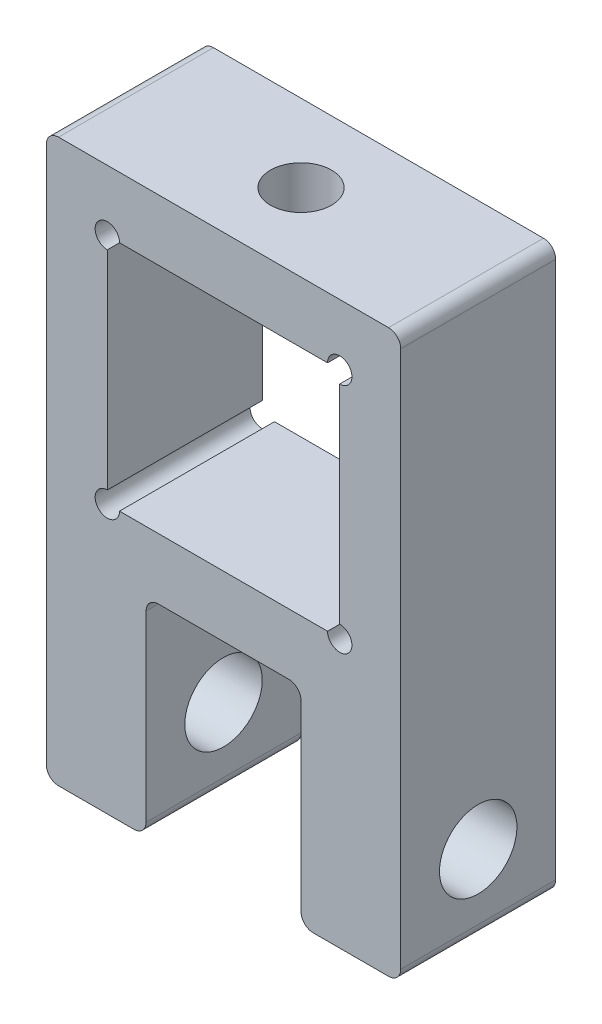
ISO-10303-21;
HEADER;
FILE_DESCRIPTION(('STEP AP214'),'2;1');
FILE_NAME('part.step','',(''),(''),'','','');
FILE_SCHEMA(('AUTOMOTIVE_DESIGN { 1 0 10303 214 1 1 1 1 }'));
ENDSEC;
DATA;
#1=APPLICATION_CONTEXT('core data for automotive mechanical design processes');
#2=APPLICATION_PROTOCOL_DEFINITION('international standard','automotive_design',2000,#1);
#3=PRODUCT_CONTEXT('',#1,'mechanical');
#4=PRODUCT('Part','Part','',(#3));
#5=PRODUCT_RELATED_PRODUCT_CATEGORY('part','',(#4));
#6=PRODUCT_DEFINITION_FORMATION('','',#4);
#7=PRODUCT_DEFINITION_CONTEXT('part definition',#1,'design');
#8=PRODUCT_DEFINITION('design','',#6,#7);
#9=PRODUCT_DEFINITION_SHAPE('','',#8);
#10=(LENGTH_UNIT() NAMED_UNIT(*) SI_UNIT(.MILLI.,.METRE.));
#11=(NAMED_UNIT(*) PLANE_ANGLE_UNIT() SI_UNIT($,.RADIAN.));
#12=(NAMED_UNIT(*) SI_UNIT($,.STERADIAN.) SOLID_ANGLE_UNIT());
#13=UNCERTAINTY_MEASURE_WITH_UNIT(LENGTH_MEASURE(1.E-05),#10,'distance_accuracy_value','');
#14=(GEOMETRIC_REPRESENTATION_CONTEXT(3) GLOBAL_UNCERTAINTY_ASSIGNED_CONTEXT((#13)) GLOBAL_UNIT_ASSIGNED_CONTEXT((#10,
#11,#12)) REPRESENTATION_CONTEXT('',''));
#15=CARTESIAN_POINT('',(0.,0.,0.));
#16=DIRECTION('',(0.,0.,1.));
#17=DIRECTION('',(1.,0.,0.));
#18=AXIS2_PLACEMENT_3D('',#15,#16,#17);
#19=CARTESIAN_POINT('',(-9.525,22.,12.7));
#20=DIRECTION('',(0.,0.,-1.));
#21=DIRECTION('',(-1.,0.,0.));
#22=AXIS2_PLACEMENT_3D('',#19,#20,#21);
#23=CYLINDRICAL_SURFACE('',#22,1.);
#24=CARTESIAN_POINT('',(-9.525,22.,0.));
#25=DIRECTION('',(0.,0.,1.));
#26=DIRECTION('',(1.,0.,0.));
#27=AXIS2_PLACEMENT_3D('',#24,#25,#26);
#28=CIRCLE('',#27,1.);
#29=CARTESIAN_POINT('',(-9.525,23.,0.));
#30=VERTEX_POINT('',#29);
#31=CARTESIAN_POINT('',(-8.525,22.,0.));
#32=VERTEX_POINT('',#31);
#33=EDGE_CURVE('E202',#30,#32,#28,.T.);
#34=ORIENTED_EDGE('',*,*,#33,.F.);
#35=DIRECTION('',(0.,0.,-1.));
#36=VECTOR('',#35,1.);
#37=CARTESIAN_POINT('',(-9.525,23.,12.7));
#38=LINE('',#37,#36);
#39=CARTESIAN_POINT('',(-9.525,23.,12.7));
#40=VERTEX_POINT('',#39);
#41=EDGE_CURVE('E197',#40,#30,#38,.T.);
#42=ORIENTED_EDGE('',*,*,#41,.F.);
#43=CARTESIAN_POINT('',(-9.525,22.,12.7));
#44=DIRECTION('',(0.,0.,1.));
#45=DIRECTION('',(1.,0.,0.));
#46=AXIS2_PLACEMENT_3D('',#43,#44,#45);
#47=CIRCLE('',#46,1.);
#48=CARTESIAN_POINT('',(-8.525,22.,12.7));
#49=VERTEX_POINT('',#48);
#50=EDGE_CURVE('E200',#40,#49,#47,.T.);
#51=ORIENTED_EDGE('',*,*,#50,.T.);
#52=DIRECTION('',(0.,0.,-1.));
#53=VECTOR('',#52,1.);
#54=CARTESIAN_POINT('',(-8.525,22.,12.7));
#55=LINE('',#54,#53);
#56=EDGE_CURVE('E240',#49,#32,#55,.T.);
#57=ORIENTED_EDGE('',*,*,#56,.T.);
#58=EDGE_LOOP('',(#34,#42,#51,#57));
#59=FACE_BOUND('',#58,.T.);
#60=ADVANCED_FACE('F35',(#59),#23,.F.);
#61=CARTESIAN_POINT('',(-9.525,0.,12.7));
#62=DIRECTION('',(-1.,0.,0.));
#63=DIRECTION('',(0.,0.,1.));
#64=AXIS2_PLACEMENT_3D('',#61,#62,#63);
#65=PLANE('',#64);
#66=DIRECTION('',(0.,1.,0.));
#67=VECTOR('',#66,1.);
#68=CARTESIAN_POINT('',(-9.525,0.,0.));
#69=LINE('',#68,#67);
#70=CARTESIAN_POINT('',(-9.525,40.05,0.));
#71=VERTEX_POINT('',#70);
#72=EDGE_CURVE('E267',#30,#71,#69,.T.);
#73=ORIENTED_EDGE('',*,*,#72,.T.);
#74=DIRECTION('',(0.,0.,-1.));
#75=VECTOR('',#74,1.);
#76=CARTESIAN_POINT('',(-9.525,40.05,12.7));
#77=LINE('',#76,#75);
#78=CARTESIAN_POINT('',(-9.525,40.05,12.7));
#79=VERTEX_POINT('',#78);
#80=EDGE_CURVE('E207',#79,#71,#77,.T.);
#81=ORIENTED_EDGE('',*,*,#80,.F.);
#82=DIRECTION('',(0.,1.,0.));
#83=VECTOR('',#82,1.);
#84=CARTESIAN_POINT('',(-9.525,0.,12.7));
#85=LINE('',#84,#83);
#86=EDGE_CURVE('E210',#40,#79,#85,.T.);
#87=ORIENTED_EDGE('',*,*,#86,.F.);
#88=ORIENTED_EDGE('',*,*,#41,.T.);
#89=EDGE_LOOP('',(#73,#81,#87,#88));
#90=FACE_BOUND('',#89,.T.);
#91=ADVANCED_FACE('F211',(#90),#65,.F.);
#92=CARTESIAN_POINT('',(-9.525,41.05,12.7));
#93=DIRECTION('',(0.,0.,-1.));
#94=DIRECTION('',(-1.,0.,0.));
#95=AXIS2_PLACEMENT_3D('',#92,#93,#94);
#96=CYLINDRICAL_SURFACE('',#95,1.);
#97=CARTESIAN_POINT('',(-9.525,41.05,0.));
#98=DIRECTION('',(0.,0.,1.));
#99=DIRECTION('',(1.,0.,0.));
#100=AXIS2_PLACEMENT_3D('',#97,#98,#99);
#101=CIRCLE('',#100,1.);
#102=CARTESIAN_POINT('',(-8.525,41.05,0.));
#103=VERTEX_POINT('',#102);
#104=EDGE_CURVE('E269',#103,#71,#101,.T.);
#105=ORIENTED_EDGE('',*,*,#104,.F.);
#106=DIRECTION('',(0.,0.,-1.));
#107=VECTOR('',#106,1.);
#108=CARTESIAN_POINT('',(-8.525,41.05,12.7));
#109=LINE('',#108,#107);
#110=CARTESIAN_POINT('',(-8.525,41.05,12.7));
#111=VERTEX_POINT('',#110);
#112=EDGE_CURVE('E299',#111,#103,#109,.T.);
#113=ORIENTED_EDGE('',*,*,#112,.F.);
#114=CARTESIAN_POINT('',(-9.525,41.05,12.7));
#115=DIRECTION('',(0.,0.,1.));
#116=DIRECTION('',(1.,0.,0.));
#117=AXIS2_PLACEMENT_3D('',#114,#115,#116);
#118=CIRCLE('',#117,1.);
#119=EDGE_CURVE('E215',#111,#79,#118,.T.);
#120=ORIENTED_EDGE('',*,*,#119,.T.);
#121=ORIENTED_EDGE('',*,*,#80,.T.);
#122=EDGE_LOOP('',(#105,#113,#120,#121));
#123=FACE_BOUND('',#122,.T.);
#124=ADVANCED_FACE('F426',(#123),#96,.F.);
#125=CARTESIAN_POINT('',(0.,41.05,12.7));
#126=DIRECTION('',(0.,1.,0.));
#127=DIRECTION('',(0.,0.,1.));
#128=AXIS2_PLACEMENT_3D('',#125,#126,#127);
#129=PLANE('',#128);
#130=CARTESIAN_POINT('',(0.,41.05,6.35));
#131=DIRECTION('',(0.,1.,0.));
#132=DIRECTION('',(0.,0.,1.));
#133=AXIS2_PLACEMENT_3D('',#130,#131,#132);
#134=CIRCLE('',#133,2.5);
#135=CARTESIAN_POINT('',(0.,41.05,8.85));
#136=VERTEX_POINT('',#135);
#137=EDGE_CURVE('E413',#136,#136,#134,.F.);
#138=ORIENTED_EDGE('',*,*,#137,.F.);
#139=EDGE_LOOP('',(#138));
#140=FACE_BOUND('',#139,.T.);
#141=DIRECTION('',(1.,0.,0.));
#142=VECTOR('',#141,1.);
#143=CARTESIAN_POINT('',(0.,41.05,0.));
#144=LINE('',#143,#142);
#145=CARTESIAN_POINT('',(8.525,41.05,0.));
#146=VERTEX_POINT('',#145);
#147=EDGE_CURVE('E272',#103,#146,#144,.T.);
#148=ORIENTED_EDGE('',*,*,#147,.T.);
#149=DIRECTION('',(0.,0.,-1.));
#150=VECTOR('',#149,1.);
#151=CARTESIAN_POINT('',(8.525,41.05,12.7));
#152=LINE('',#151,#150);
#153=CARTESIAN_POINT('',(8.525,41.05,12.7));
#154=VERTEX_POINT('',#153);
#155=EDGE_CURVE('E296',#154,#146,#152,.T.);
#156=ORIENTED_EDGE('',*,*,#155,.F.);
#157=DIRECTION('',(1.,0.,0.));
#158=VECTOR('',#157,1.);
#159=CARTESIAN_POINT('',(0.,41.05,12.7));
#160=LINE('',#159,#158);
#161=EDGE_CURVE('E229',#111,#154,#160,.T.);
#162=ORIENTED_EDGE('',*,*,#161,.F.);
#163=ORIENTED_EDGE('',*,*,#112,.T.);
#164=EDGE_LOOP('',(#148,#156,#162,#163));
#165=FACE_BOUND('',#164,.T.);
#166=ADVANCED_FACE('F422',(#140,#165),#129,.F.);
#167=CARTESIAN_POINT('',(9.525,41.05,12.7));
#168=DIRECTION('',(0.,0.,-1.));
#169=DIRECTION('',(-1.,0.,0.));
#170=AXIS2_PLACEMENT_3D('',#167,#168,#169);
#171=CYLINDRICAL_SURFACE('',#170,1.);
#172=CARTESIAN_POINT('',(9.525,41.05,0.));
#173=DIRECTION('',(0.,0.,1.));
#174=DIRECTION('',(1.,0.,0.));
#175=AXIS2_PLACEMENT_3D('',#172,#173,#174);
#176=CIRCLE('',#175,1.);
#177=CARTESIAN_POINT('',(9.525,40.05,0.));
#178=VERTEX_POINT('',#177);
#179=EDGE_CURVE('E275',#146,#178,#176,.F.);
#180=ORIENTED_EDGE('',*,*,#179,.T.);
#181=DIRECTION('',(0.,0.,-1.));
#182=VECTOR('',#181,1.);
#183=CARTESIAN_POINT('',(9.525,40.05,12.7));
#184=LINE('',#183,#182);
#185=CARTESIAN_POINT('',(9.525,40.05,12.7));
#186=VERTEX_POINT('',#185);
#187=EDGE_CURVE('E294',#186,#178,#184,.T.);
#188=ORIENTED_EDGE('',*,*,#187,.F.);
#189=CARTESIAN_POINT('',(9.525,41.05,12.7));
#190=DIRECTION('',(0.,0.,1.));
#191=DIRECTION('',(1.,0.,0.));
#192=AXIS2_PLACEMENT_3D('',#189,#190,#191);
#193=CIRCLE('',#192,1.);
#194=EDGE_CURVE('E232',#154,#186,#193,.F.);
#195=ORIENTED_EDGE('',*,*,#194,.F.);
#196=ORIENTED_EDGE('',*,*,#155,.T.);
#197=EDGE_LOOP('',(#180,#188,#195,#196));
#198=FACE_BOUND('',#197,.T.);
#199=ADVANCED_FACE('F425',(#198),#171,.F.);
#200=CARTESIAN_POINT('',(9.525,0.,12.7));
#201=DIRECTION('',(-1.,0.,0.));
#202=DIRECTION('',(0.,0.,1.));
#203=AXIS2_PLACEMENT_3D('',#200,#201,#202);
#204=PLANE('',#203);
#205=DIRECTION('',(0.,1.,0.));
#206=VECTOR('',#205,1.);
#207=CARTESIAN_POINT('',(9.525,0.,0.));
#208=LINE('',#207,#206);
#209=CARTESIAN_POINT('',(9.525,23.,0.));
#210=VERTEX_POINT('',#209);
#211=EDGE_CURVE('E278',#210,#178,#208,.T.);
#212=ORIENTED_EDGE('',*,*,#211,.F.);
#213=DIRECTION('',(0.,0.,-1.));
#214=VECTOR('',#213,1.);
#215=CARTESIAN_POINT('',(9.525,23.,12.7));
#216=LINE('',#215,#214);
#217=CARTESIAN_POINT('',(9.525,23.,12.7));
#218=VERTEX_POINT('',#217);
#219=EDGE_CURVE('E292',#218,#210,#216,.T.);
#220=ORIENTED_EDGE('',*,*,#219,.F.);
#221=DIRECTION('',(0.,1.,0.));
#222=VECTOR('',#221,1.);
#223=CARTESIAN_POINT('',(9.525,0.,12.7));
#224=LINE('',#223,#222);
#225=EDGE_CURVE('E234',#218,#186,#224,.T.);
#226=ORIENTED_EDGE('',*,*,#225,.T.);
#227=ORIENTED_EDGE('',*,*,#187,.T.);
#228=EDGE_LOOP('',(#212,#220,#226,#227));
#229=FACE_BOUND('',#228,.T.);
#230=ADVANCED_FACE('F443',(#229),#204,.T.);
#231=CARTESIAN_POINT('',(9.525,22.,12.7));
#232=DIRECTION('',(0.,0.,-1.));
#233=DIRECTION('',(-1.,0.,0.));
#234=AXIS2_PLACEMENT_3D('',#231,#232,#233);
#235=CYLINDRICAL_SURFACE('',#234,1.);
#236=CARTESIAN_POINT('',(9.525,22.,0.));
#237=DIRECTION('',(0.,0.,1.));
#238=DIRECTION('',(1.,0.,0.));
#239=AXIS2_PLACEMENT_3D('',#236,#237,#238);
#240=CIRCLE('',#239,1.);
#241=CARTESIAN_POINT('',(8.525,22.,0.));
#242=VERTEX_POINT('',#241);
#243=EDGE_CURVE('E281',#210,#242,#240,.F.);
#244=ORIENTED_EDGE('',*,*,#243,.T.);
#245=DIRECTION('',(0.,0.,-1.));
#246=VECTOR('',#245,1.);
#247=CARTESIAN_POINT('',(8.525,22.,12.7));
#248=LINE('',#247,#246);
#249=CARTESIAN_POINT('',(8.525,22.,12.7));
#250=VERTEX_POINT('',#249);
#251=EDGE_CURVE('E289',#250,#242,#248,.T.);
#252=ORIENTED_EDGE('',*,*,#251,.F.);
#253=CARTESIAN_POINT('',(9.525,22.,12.7));
#254=DIRECTION('',(0.,0.,1.));
#255=DIRECTION('',(1.,0.,0.));
#256=AXIS2_PLACEMENT_3D('',#253,#254,#255);
#257=CIRCLE('',#256,1.);
#258=EDGE_CURVE('E237',#218,#250,#257,.F.);
#259=ORIENTED_EDGE('',*,*,#258,.F.);
#260=ORIENTED_EDGE('',*,*,#219,.T.);
#261=EDGE_LOOP('',(#244,#252,#259,#260));
#262=FACE_BOUND('',#261,.T.);
#263=ADVANCED_FACE('F440',(#262),#235,.F.);
#264=CARTESIAN_POINT('',(14.525,0.,12.7));
#265=DIRECTION('',(1.,0.,0.));
#266=DIRECTION('',(0.,1.,0.));
#267=AXIS2_PLACEMENT_3D('',#264,#265,#266);
#268=PLANE('',#267);
#269=CARTESIAN_POINT('',(14.525,6.35,6.35));
#270=DIRECTION('',(1.,0.,0.));
#271=DIRECTION('',(0.,1.,0.));
#272=AXIS2_PLACEMENT_3D('',#269,#270,#271);
#273=CIRCLE('',#272,3.175);
#274=CARTESIAN_POINT('',(14.525,9.525,6.35));
#275=VERTEX_POINT('',#274);
#276=EDGE_CURVE('E410',#275,#275,#273,.T.);
#277=ORIENTED_EDGE('',*,*,#276,.F.);
#278=EDGE_LOOP('',(#277));
#279=FACE_BOUND('',#278,.T.);
#280=DIRECTION('',(0.,-1.,0.));
#281=VECTOR('',#280,1.);
#282=CARTESIAN_POINT('',(14.525,0.,12.7));
#283=LINE('',#282,#281);
#284=CARTESIAN_POINT('',(14.525,45.05,12.7));
#285=VERTEX_POINT('',#284);
#286=CARTESIAN_POINT('',(14.525,1.,12.7));
#287=VERTEX_POINT('',#286);
#288=EDGE_CURVE('E287',#285,#287,#283,.T.);
#289=ORIENTED_EDGE('',*,*,#288,.T.);
#290=DIRECTION('',(0.,0.,-1.));
#291=VECTOR('',#290,1.);
#292=CARTESIAN_POINT('',(14.525,1.,12.7));
#293=LINE('',#292,#291);
#294=CARTESIAN_POINT('',(14.525,1.,0.));
#295=VERTEX_POINT('',#294);
#296=EDGE_CURVE('E307',#287,#295,#293,.T.);
#297=ORIENTED_EDGE('',*,*,#296,.T.);
#298=DIRECTION('',(0.,-1.,0.));
#299=VECTOR('',#298,1.);
#300=CARTESIAN_POINT('',(14.525,0.,0.));
#301=LINE('',#300,#299);
#302=CARTESIAN_POINT('',(14.525,45.05,0.));
#303=VERTEX_POINT('',#302);
#304=EDGE_CURVE('E241',#303,#295,#301,.T.);
#305=ORIENTED_EDGE('',*,*,#304,.F.);
#306=DIRECTION('',(0.,0.,-1.));
#307=VECTOR('',#306,1.);
#308=CARTESIAN_POINT('',(14.525,45.05,12.7));
#309=LINE('',#308,#307);
#310=EDGE_CURVE('E206',#303,#285,#309,.F.);
#311=ORIENTED_EDGE('',*,*,#310,.T.);
#312=EDGE_LOOP('',(#289,#297,#305,#311));
#313=FACE_BOUND('',#312,.T.);
#314=ADVANCED_FACE('F484',(#279,#313),#268,.T.);
#315=CARTESIAN_POINT('',(0.,46.05,12.7));
#316=DIRECTION('',(0.,-1.,0.));
#317=DIRECTION('',(0.,0.,-1.));
#318=AXIS2_PLACEMENT_3D('',#315,#316,#317);
#319=PLANE('',#318);
#320=CARTESIAN_POINT('',(0.,46.05,6.35));
#321=DIRECTION('',(0.,1.,0.));
#322=DIRECTION('',(0.,0.,1.));
#323=AXIS2_PLACEMENT_3D('',#320,#321,#322);
#324=CIRCLE('',#323,2.5);
#325=CARTESIAN_POINT('',(0.,46.05,8.85));
#326=VERTEX_POINT('',#325);
#327=EDGE_CURVE('E414',#326,#326,#324,.T.);
#328=ORIENTED_EDGE('',*,*,#327,.F.);
#329=EDGE_LOOP('',(#328));
#330=FACE_BOUND('',#329,.T.);
#331=DIRECTION('',(-1.,0.,0.));
#332=VECTOR('',#331,1.);
#333=CARTESIAN_POINT('',(0.,46.05,0.));
#334=LINE('',#333,#332);
#335=CARTESIAN_POINT('',(13.525,46.05,0.));
#336=VERTEX_POINT('',#335);
#337=CARTESIAN_POINT('',(-13.525,46.05,0.));
#338=VERTEX_POINT('',#337);
#339=EDGE_CURVE('E244',#336,#338,#334,.T.);
#340=ORIENTED_EDGE('',*,*,#339,.T.);
#341=DIRECTION('',(0.,0.,-1.));
#342=VECTOR('',#341,1.);
#343=CARTESIAN_POINT('',(-13.525,46.05,12.7));
#344=LINE('',#343,#342);
#345=CARTESIAN_POINT('',(-13.525,46.05,12.7));
#346=VERTEX_POINT('',#345);
#347=EDGE_CURVE('E347',#338,#346,#344,.F.);
#348=ORIENTED_EDGE('',*,*,#347,.T.);
#349=DIRECTION('',(-1.,0.,0.));
#350=VECTOR('',#349,1.);
#351=CARTESIAN_POINT('',(0.,46.05,12.7));
#352=LINE('',#351,#350);
#353=CARTESIAN_POINT('',(13.525,46.05,12.7));
#354=VERTEX_POINT('',#353);
#355=EDGE_CURVE('E401',#354,#346,#352,.T.);
#356=ORIENTED_EDGE('',*,*,#355,.F.);
#357=DIRECTION('',(0.,0.,-1.));
#358=VECTOR('',#357,1.);
#359=CARTESIAN_POINT('',(13.525,46.05,0.));
#360=LINE('',#359,#358);
#361=EDGE_CURVE('E344',#354,#336,#360,.T.);
#362=ORIENTED_EDGE('',*,*,#361,.T.);
#363=EDGE_LOOP('',(#340,#348,#356,#362));
#364=FACE_BOUND('',#363,.T.);
#365=ADVANCED_FACE('F480',(#330,#364),#319,.F.);
#366=CARTESIAN_POINT('',(-14.525,0.,12.7));
#367=DIRECTION('',(1.,0.,0.));
#368=DIRECTION('',(0.,1.,0.));
#369=AXIS2_PLACEMENT_3D('',#366,#367,#368);
#370=PLANE('',#369);
#371=CARTESIAN_POINT('',(-14.525,6.35,6.35));
#372=DIRECTION('',(1.,0.,0.));
#373=DIRECTION('',(0.,1.,0.));
#374=AXIS2_PLACEMENT_3D('',#371,#372,#373);
#375=CIRCLE('',#374,3.175);
#376=CARTESIAN_POINT('',(-14.525,9.525,6.35));
#377=VERTEX_POINT('',#376);
#378=EDGE_CURVE('E305',#377,#377,#375,.T.);
#379=ORIENTED_EDGE('',*,*,#378,.T.);
#380=EDGE_LOOP('',(#379));
#381=FACE_BOUND('',#380,.T.);
#382=DIRECTION('',(0.,-1.,0.));
#383=VECTOR('',#382,1.);
#384=CARTESIAN_POINT('',(-14.525,0.,12.7));
#385=LINE('',#384,#383);
#386=CARTESIAN_POINT('',(-14.525,45.05,12.7));
#387=VERTEX_POINT('',#386);
#388=CARTESIAN_POINT('',(-14.525,1.,12.7));
#389=VERTEX_POINT('',#388);
#390=EDGE_CURVE('E398',#387,#389,#385,.T.);
#391=ORIENTED_EDGE('',*,*,#390,.F.);
#392=DIRECTION('',(0.,0.,-1.));
#393=VECTOR('',#392,1.);
#394=CARTESIAN_POINT('',(-14.525,45.05,12.7));
#395=LINE('',#394,#393);
#396=CARTESIAN_POINT('',(-14.525,45.05,0.));
#397=VERTEX_POINT('',#396);
#398=EDGE_CURVE('E341',#387,#397,#395,.T.);
#399=ORIENTED_EDGE('',*,*,#398,.T.);
#400=DIRECTION('',(0.,-1.,0.));
#401=VECTOR('',#400,1.);
#402=CARTESIAN_POINT('',(-14.525,0.,0.));
#403=LINE('',#402,#401);
#404=CARTESIAN_POINT('',(-14.525,1.,0.));
#405=VERTEX_POINT('',#404);
#406=EDGE_CURVE('E248',#397,#405,#403,.T.);
#407=ORIENTED_EDGE('',*,*,#406,.T.);
#408=DIRECTION('',(0.,0.,-1.));
#409=VECTOR('',#408,1.);
#410=CARTESIAN_POINT('',(-14.525,1.,12.7));
#411=LINE('',#410,#409);
#412=EDGE_CURVE('E339',#405,#389,#411,.F.);
#413=ORIENTED_EDGE('',*,*,#412,.T.);
#414=EDGE_LOOP('',(#391,#399,#407,#413));
#415=FACE_BOUND('',#414,.T.);
#416=ADVANCED_FACE('F476',(#381,#415),#370,.F.);
#417=CARTESIAN_POINT('',(0.,0.,12.7));
#418=DIRECTION('',(0.,1.,0.));
#419=DIRECTION('',(0.,0.,1.));
#420=AXIS2_PLACEMENT_3D('',#417,#418,#419);
#421=PLANE('',#420);
#422=DIRECTION('',(1.,0.,0.));
#423=VECTOR('',#422,1.);
#424=CARTESIAN_POINT('',(0.,0.,12.7));
#425=LINE('',#424,#423);
#426=CARTESIAN_POINT('',(-13.525,0.,12.7));
#427=VERTEX_POINT('',#426);
#428=CARTESIAN_POINT('',(-7.35,0.,12.7));
#429=VERTEX_POINT('',#428);
#430=EDGE_CURVE('E393',#427,#429,#425,.T.);
#431=ORIENTED_EDGE('',*,*,#430,.F.);
#432=DIRECTION('',(0.,0.,-1.));
#433=VECTOR('',#432,1.);
#434=CARTESIAN_POINT('',(-13.525,0.,12.7));
#435=LINE('',#434,#433);
#436=CARTESIAN_POINT('',(-13.525,0.,0.));
#437=VERTEX_POINT('',#436);
#438=EDGE_CURVE('E351',#427,#437,#435,.T.);
#439=ORIENTED_EDGE('',*,*,#438,.T.);
#440=DIRECTION('',(1.,0.,0.));
#441=VECTOR('',#440,1.);
#442=CARTESIAN_POINT('',(0.,0.,0.));
#443=LINE('',#442,#441);
#444=CARTESIAN_POINT('',(-7.35,0.,0.));
#445=VERTEX_POINT('',#444);
#446=EDGE_CURVE('E251',#437,#445,#443,.T.);
#447=ORIENTED_EDGE('',*,*,#446,.T.);
#448=DIRECTION('',(0.,0.,-1.));
#449=VECTOR('',#448,1.);
#450=CARTESIAN_POINT('',(-7.35,0.,12.7));
#451=LINE('',#450,#449);
#452=EDGE_CURVE('E349',#445,#429,#451,.F.);
#453=ORIENTED_EDGE('',*,*,#452,.T.);
#454=EDGE_LOOP('',(#431,#439,#447,#453));
#455=FACE_BOUND('',#454,.T.);
#456=ADVANCED_FACE('F472',(#455),#421,.F.);
#457=CARTESIAN_POINT('',(-6.35,0.,12.7));
#458=DIRECTION('',(-1.,0.,0.));
#459=DIRECTION('',(0.,0.,1.));
#460=AXIS2_PLACEMENT_3D('',#457,#458,#459);
#461=PLANE('',#460);
#462=CARTESIAN_POINT('',(-6.35,6.35,6.35));
#463=DIRECTION('',(-1.,0.,0.));
#464=DIRECTION('',(0.,0.,1.));
#465=AXIS2_PLACEMENT_3D('',#462,#463,#464);
#466=CIRCLE('',#465,3.175);
#467=CARTESIAN_POINT('',(-6.35,6.35,9.525));
#468=VERTEX_POINT('',#467);
#469=EDGE_CURVE('E245',#468,#468,#466,.T.);
#470=ORIENTED_EDGE('',*,*,#469,.T.);
#471=EDGE_LOOP('',(#470));
#472=FACE_BOUND('',#471,.T.);
#473=DIRECTION('',(0.,1.,0.));
#474=VECTOR('',#473,1.);
#475=CARTESIAN_POINT('',(-6.35,0.,12.7));
#476=LINE('',#475,#474);
#477=CARTESIAN_POINT('',(-6.35,1.,12.7));
#478=VERTEX_POINT('',#477);
#479=CARTESIAN_POINT('',(-6.35,16.,12.7));
#480=VERTEX_POINT('',#479);
#481=EDGE_CURVE('E388',#478,#480,#476,.T.);
#482=ORIENTED_EDGE('',*,*,#481,.F.);
#483=DIRECTION('',(0.,0.,-1.));
#484=VECTOR('',#483,1.);
#485=CARTESIAN_POINT('',(-6.35,1.,12.7));
#486=LINE('',#485,#484);
#487=CARTESIAN_POINT('',(-6.35,1.,0.));
#488=VERTEX_POINT('',#487);
#489=EDGE_CURVE('E356',#478,#488,#486,.T.);
#490=ORIENTED_EDGE('',*,*,#489,.T.);
#491=DIRECTION('',(0.,1.,0.));
#492=VECTOR('',#491,1.);
#493=CARTESIAN_POINT('',(-6.35,0.,0.));
#494=LINE('',#493,#492);
#495=CARTESIAN_POINT('',(-6.35,16.,0.));
#496=VERTEX_POINT('',#495);
#497=EDGE_CURVE('E254',#488,#496,#494,.T.);
#498=ORIENTED_EDGE('',*,*,#497,.T.);
#499=DIRECTION('',(0.,0.,-1.));
#500=VECTOR('',#499,1.);
#501=CARTESIAN_POINT('',(-6.35,16.,12.7));
#502=LINE('',#501,#500);
#503=EDGE_CURVE('E354',#496,#480,#502,.F.);
#504=ORIENTED_EDGE('',*,*,#503,.T.);
#505=EDGE_LOOP('',(#482,#490,#498,#504));
#506=FACE_BOUND('',#505,.T.);
#507=ADVANCED_FACE('F380',(#472,#506),#461,.F.);
#508=CARTESIAN_POINT('',(0.,17.,12.7));
#509=DIRECTION('',(0.,1.,0.));
#510=DIRECTION('',(0.,0.,1.));
#511=AXIS2_PLACEMENT_3D('',#508,#509,#510);
#512=PLANE('',#511);
#513=DIRECTION('',(1.,0.,0.));
#514=VECTOR('',#513,1.);
#515=CARTESIAN_POINT('',(0.,17.,0.));
#516=LINE('',#515,#514);
#517=CARTESIAN_POINT('',(-5.35,17.,0.));
#518=VERTEX_POINT('',#517);
#519=CARTESIAN_POINT('',(5.35,17.,0.));
#520=VERTEX_POINT('',#519);
#521=EDGE_CURVE('E257',#518,#520,#516,.T.);
#522=ORIENTED_EDGE('',*,*,#521,.T.);
#523=DIRECTION('',(0.,0.,-1.));
#524=VECTOR('',#523,1.);
#525=CARTESIAN_POINT('',(5.35,17.,12.7));
#526=LINE('',#525,#524);
#527=CARTESIAN_POINT('',(5.35,17.,12.7));
#528=VERTEX_POINT('',#527);
#529=EDGE_CURVE('E366',#520,#528,#526,.F.);
#530=ORIENTED_EDGE('',*,*,#529,.T.);
#531=DIRECTION('',(1.,0.,0.));
#532=VECTOR('',#531,1.);
#533=CARTESIAN_POINT('',(0.,17.,12.7));
#534=LINE('',#533,#532);
#535=CARTESIAN_POINT('',(-5.35,17.,12.7));
#536=VERTEX_POINT('',#535);
#537=EDGE_CURVE('E387',#536,#528,#534,.T.);
#538=ORIENTED_EDGE('',*,*,#537,.F.);
#539=DIRECTION('',(0.,0.,-1.));
#540=VECTOR('',#539,1.);
#541=CARTESIAN_POINT('',(-5.35,17.,0.));
#542=LINE('',#541,#540);
#543=EDGE_CURVE('E363',#536,#518,#542,.T.);
#544=ORIENTED_EDGE('',*,*,#543,.T.);
#545=EDGE_LOOP('',(#522,#530,#538,#544));
#546=FACE_BOUND('',#545,.T.);
#547=ADVANCED_FACE('F390',(#546),#512,.F.);
#548=CARTESIAN_POINT('',(6.35,0.,12.7));
#549=DIRECTION('',(-1.,0.,0.));
#550=DIRECTION('',(0.,0.,1.));
#551=AXIS2_PLACEMENT_3D('',#548,#549,#550);
#552=PLANE('',#551);
#553=CARTESIAN_POINT('',(6.35,6.35,6.35));
#554=DIRECTION('',(-1.,0.,0.));
#555=DIRECTION('',(0.,0.,1.));
#556=AXIS2_PLACEMENT_3D('',#553,#554,#555);
#557=CIRCLE('',#556,3.175);
#558=CARTESIAN_POINT('',(6.35,6.35,9.525));
#559=VERTEX_POINT('',#558);
#560=EDGE_CURVE('E302',#559,#559,#557,.T.);
#561=ORIENTED_EDGE('',*,*,#560,.F.);
#562=EDGE_LOOP('',(#561));
#563=FACE_BOUND('',#562,.T.);
#564=DIRECTION('',(0.,1.,0.));
#565=VECTOR('',#564,1.);
#566=CARTESIAN_POINT('',(6.35,0.,0.));
#567=LINE('',#566,#565);
#568=CARTESIAN_POINT('',(6.35,1.,0.));
#569=VERTEX_POINT('',#568);
#570=CARTESIAN_POINT('',(6.35,16.,0.));
#571=VERTEX_POINT('',#570);
#572=EDGE_CURVE('E260',#569,#571,#567,.T.);
#573=ORIENTED_EDGE('',*,*,#572,.F.);
#574=DIRECTION('',(0.,0.,-1.));
#575=VECTOR('',#574,1.);
#576=CARTESIAN_POINT('',(6.35,1.,12.7));
#577=LINE('',#576,#575);
#578=CARTESIAN_POINT('',(6.35,1.,12.7));
#579=VERTEX_POINT('',#578);
#580=EDGE_CURVE('E57',#569,#579,#577,.F.);
#581=ORIENTED_EDGE('',*,*,#580,.T.);
#582=DIRECTION('',(0.,1.,0.));
#583=VECTOR('',#582,1.);
#584=CARTESIAN_POINT('',(6.35,0.,12.7));
#585=LINE('',#584,#583);
#586=CARTESIAN_POINT('',(6.35,16.,12.7));
#587=VERTEX_POINT('',#586);
#588=EDGE_CURVE('E224',#579,#587,#585,.T.);
#589=ORIENTED_EDGE('',*,*,#588,.T.);
#590=DIRECTION('',(0.,0.,-1.));
#591=VECTOR('',#590,1.);
#592=CARTESIAN_POINT('',(6.35,16.,12.7));
#593=LINE('',#592,#591);
#594=EDGE_CURVE('E359',#587,#571,#593,.T.);
#595=ORIENTED_EDGE('',*,*,#594,.T.);
#596=EDGE_LOOP('',(#573,#581,#589,#595));
#597=FACE_BOUND('',#596,.T.);
#598=ADVANCED_FACE('F463',(#563,#597),#552,.T.);
#599=CARTESIAN_POINT('',(0.,0.,12.7));
#600=DIRECTION('',(0.,-1.,0.));
#601=DIRECTION('',(0.,0.,-1.));
#602=AXIS2_PLACEMENT_3D('',#599,#600,#601);
#603=PLANE('',#602);
#604=DIRECTION('',(-1.,0.,0.));
#605=VECTOR('',#604,1.);
#606=CARTESIAN_POINT('',(0.,0.,0.));
#607=LINE('',#606,#605);
#608=CARTESIAN_POINT('',(13.525,0.,0.));
#609=VERTEX_POINT('',#608);
#610=CARTESIAN_POINT('',(7.35,0.,0.));
#611=VERTEX_POINT('',#610);
#612=EDGE_CURVE('E263',#609,#611,#607,.T.);
#613=ORIENTED_EDGE('',*,*,#612,.F.);
#614=DIRECTION('',(0.,0.,-1.));
#615=VECTOR('',#614,1.);
#616=CARTESIAN_POINT('',(13.525,0.,12.7));
#617=LINE('',#616,#615);
#618=CARTESIAN_POINT('',(13.525,0.,12.7));
#619=VERTEX_POINT('',#618);
#620=EDGE_CURVE('E325',#609,#619,#617,.F.);
#621=ORIENTED_EDGE('',*,*,#620,.T.);
#622=DIRECTION('',(-1.,0.,0.));
#623=VECTOR('',#622,1.);
#624=CARTESIAN_POINT('',(0.,0.,12.7));
#625=LINE('',#624,#623);
#626=CARTESIAN_POINT('',(7.35,0.,12.7));
#627=VERTEX_POINT('',#626);
#628=EDGE_CURVE('E221',#619,#627,#625,.T.);
#629=ORIENTED_EDGE('',*,*,#628,.T.);
#630=DIRECTION('',(0.,0.,-1.));
#631=VECTOR('',#630,1.);
#632=CARTESIAN_POINT('',(7.35,0.,12.7));
#633=LINE('',#632,#631);
#634=EDGE_CURVE('E322',#627,#611,#633,.T.);
#635=ORIENTED_EDGE('',*,*,#634,.T.);
#636=EDGE_LOOP('',(#613,#621,#629,#635));
#637=FACE_BOUND('',#636,.T.);
#638=ADVANCED_FACE('F460',(#637),#603,.T.);
#639=CARTESIAN_POINT('',(0.,22.,12.7));
#640=DIRECTION('',(0.,-1.,0.));
#641=DIRECTION('',(0.,0.,-1.));
#642=AXIS2_PLACEMENT_3D('',#639,#640,#641);
#643=PLANE('',#642);
#644=DIRECTION('',(-1.,0.,0.));
#645=VECTOR('',#644,1.);
#646=CARTESIAN_POINT('',(0.,22.,0.));
#647=LINE('',#646,#645);
#648=EDGE_CURVE('E284',#242,#32,#647,.T.);
#649=ORIENTED_EDGE('',*,*,#648,.T.);
#650=ORIENTED_EDGE('',*,*,#56,.F.);
#651=DIRECTION('',(-1.,0.,0.));
#652=VECTOR('',#651,1.);
#653=CARTESIAN_POINT('',(0.,22.,12.7));
#654=LINE('',#653,#652);
#655=EDGE_CURVE('E219',#250,#49,#654,.T.);
#656=ORIENTED_EDGE('',*,*,#655,.F.);
#657=ORIENTED_EDGE('',*,*,#251,.T.);
#658=EDGE_LOOP('',(#649,#650,#656,#657));
#659=FACE_BOUND('',#658,.T.);
#660=ADVANCED_FACE('F437',(#659),#643,.F.);
#661=CARTESIAN_POINT('',(0.,0.,12.7));
#662=DIRECTION('',(0.,0.,1.));
#663=DIRECTION('',(1.,0.,0.));
#664=AXIS2_PLACEMENT_3D('',#661,#662,#663);
#665=PLANE('',#664);
#666=ORIENTED_EDGE('',*,*,#628,.F.);
#667=CARTESIAN_POINT('',(13.525,1.,12.7));
#668=DIRECTION('',(0.,0.,1.));
#669=DIRECTION('',(1.,0.,0.));
#670=AXIS2_PLACEMENT_3D('',#667,#668,#669);
#671=CIRCLE('',#670,1.);
#672=EDGE_CURVE('E337',#619,#287,#671,.T.);
#673=ORIENTED_EDGE('',*,*,#672,.T.);
#674=ORIENTED_EDGE('',*,*,#288,.F.);
#675=CARTESIAN_POINT('',(13.525,45.05,12.7));
#676=DIRECTION('',(0.,0.,1.));
#677=DIRECTION('',(1.,0.,0.));
#678=AXIS2_PLACEMENT_3D('',#675,#676,#677);
#679=CIRCLE('',#678,1.);
#680=EDGE_CURVE('E327',#285,#354,#679,.T.);
#681=ORIENTED_EDGE('',*,*,#680,.T.);
#682=ORIENTED_EDGE('',*,*,#355,.T.);
#683=CARTESIAN_POINT('',(-13.525,45.05,12.7));
#684=DIRECTION('',(0.,0.,1.));
#685=DIRECTION('',(1.,0.,0.));
#686=AXIS2_PLACEMENT_3D('',#683,#684,#685);
#687=CIRCLE('',#686,1.);
#688=EDGE_CURVE('E335',#346,#387,#687,.T.);
#689=ORIENTED_EDGE('',*,*,#688,.T.);
#690=ORIENTED_EDGE('',*,*,#390,.T.);
#691=CARTESIAN_POINT('',(-13.525,1.,12.7));
#692=DIRECTION('',(0.,0.,1.));
#693=DIRECTION('',(1.,0.,0.));
#694=AXIS2_PLACEMENT_3D('',#691,#692,#693);
#695=CIRCLE('',#694,1.);
#696=EDGE_CURVE('E333',#389,#427,#695,.T.);
#697=ORIENTED_EDGE('',*,*,#696,.T.);
#698=ORIENTED_EDGE('',*,*,#430,.T.);
#699=CARTESIAN_POINT('',(-7.35,1.,12.7));
#700=DIRECTION('',(0.,0.,1.));
#701=DIRECTION('',(1.,0.,0.));
#702=AXIS2_PLACEMENT_3D('',#699,#700,#701);
#703=CIRCLE('',#702,1.);
#704=EDGE_CURVE('E331',#429,#478,#703,.T.);
#705=ORIENTED_EDGE('',*,*,#704,.T.);
#706=ORIENTED_EDGE('',*,*,#481,.T.);
#707=CARTESIAN_POINT('',(-5.35,16.,12.7));
#708=DIRECTION('',(0.,0.,1.));
#709=DIRECTION('',(1.,0.,0.));
#710=AXIS2_PLACEMENT_3D('',#707,#708,#709);
#711=CIRCLE('',#710,1.);
#712=EDGE_CURVE('E11',#480,#536,#711,.F.);
#713=ORIENTED_EDGE('',*,*,#712,.T.);
#714=ORIENTED_EDGE('',*,*,#537,.T.);
#715=CARTESIAN_POINT('',(5.35,16.,12.7));
#716=DIRECTION('',(0.,0.,1.));
#717=DIRECTION('',(1.,0.,0.));
#718=AXIS2_PLACEMENT_3D('',#715,#716,#717);
#719=CIRCLE('',#718,1.);
#720=EDGE_CURVE('E50',#528,#587,#719,.F.);
#721=ORIENTED_EDGE('',*,*,#720,.T.);
#722=ORIENTED_EDGE('',*,*,#588,.F.);
#723=CARTESIAN_POINT('',(7.35,1.,12.7));
#724=DIRECTION('',(0.,0.,1.));
#725=DIRECTION('',(1.,0.,0.));
#726=AXIS2_PLACEMENT_3D('',#723,#724,#725);
#727=CIRCLE('',#726,1.);
#728=EDGE_CURVE('E329',#579,#627,#727,.T.);
#729=ORIENTED_EDGE('',*,*,#728,.T.);
#730=EDGE_LOOP('',(#666,#673,#674,#681,#682,#689,#690,#697,#698,#705,#706,#713,#714,#721,#722,#729));
#731=FACE_BOUND('',#730,.T.);
#732=ORIENTED_EDGE('',*,*,#50,.F.);
#733=ORIENTED_EDGE('',*,*,#86,.T.);
#734=ORIENTED_EDGE('',*,*,#119,.F.);
#735=ORIENTED_EDGE('',*,*,#161,.T.);
#736=ORIENTED_EDGE('',*,*,#194,.T.);
#737=ORIENTED_EDGE('',*,*,#225,.F.);
#738=ORIENTED_EDGE('',*,*,#258,.T.);
#739=ORIENTED_EDGE('',*,*,#655,.T.);
#740=EDGE_LOOP('',(#732,#733,#734,#735,#736,#737,#738,#739));
#741=FACE_BOUND('',#740,.T.);
#742=ADVANCED_FACE('F217',(#731,#741),#665,.T.);
#743=CARTESIAN_POINT('',(0.,0.,0.));
#744=DIRECTION('',(0.,0.,1.));
#745=DIRECTION('',(1.,0.,0.));
#746=AXIS2_PLACEMENT_3D('',#743,#744,#745);
#747=PLANE('',#746);
#748=ORIENTED_EDGE('',*,*,#304,.T.);
#749=CARTESIAN_POINT('',(13.525,1.,0.));
#750=DIRECTION('',(0.,0.,1.));
#751=DIRECTION('',(1.,0.,0.));
#752=AXIS2_PLACEMENT_3D('',#749,#750,#751);
#753=CIRCLE('',#752,1.);
#754=EDGE_CURVE('E320',#295,#609,#753,.F.);
#755=ORIENTED_EDGE('',*,*,#754,.T.);
#756=ORIENTED_EDGE('',*,*,#612,.T.);
#757=CARTESIAN_POINT('',(7.35,1.,0.));
#758=DIRECTION('',(0.,0.,1.));
#759=DIRECTION('',(1.,0.,0.));
#760=AXIS2_PLACEMENT_3D('',#757,#758,#759);
#761=CIRCLE('',#760,1.);
#762=EDGE_CURVE('E312',#611,#569,#761,.F.);
#763=ORIENTED_EDGE('',*,*,#762,.T.);
#764=ORIENTED_EDGE('',*,*,#572,.T.);
#765=CARTESIAN_POINT('',(5.35,16.,0.));
#766=DIRECTION('',(0.,0.,1.));
#767=DIRECTION('',(1.,0.,0.));
#768=AXIS2_PLACEMENT_3D('',#765,#766,#767);
#769=CIRCLE('',#768,1.);
#770=EDGE_CURVE('E368',#571,#520,#769,.T.);
#771=ORIENTED_EDGE('',*,*,#770,.T.);
#772=ORIENTED_EDGE('',*,*,#521,.F.);
#773=CARTESIAN_POINT('',(-5.35,16.,0.));
#774=DIRECTION('',(0.,0.,1.));
#775=DIRECTION('',(1.,0.,0.));
#776=AXIS2_PLACEMENT_3D('',#773,#774,#775);
#777=CIRCLE('',#776,1.);
#778=EDGE_CURVE('E43',#518,#496,#777,.T.);
#779=ORIENTED_EDGE('',*,*,#778,.T.);
#780=ORIENTED_EDGE('',*,*,#497,.F.);
#781=CARTESIAN_POINT('',(-7.35,1.,0.));
#782=DIRECTION('',(0.,0.,1.));
#783=DIRECTION('',(1.,0.,0.));
#784=AXIS2_PLACEMENT_3D('',#781,#782,#783);
#785=CIRCLE('',#784,1.);
#786=EDGE_CURVE('E314',#488,#445,#785,.F.);
#787=ORIENTED_EDGE('',*,*,#786,.T.);
#788=ORIENTED_EDGE('',*,*,#446,.F.);
#789=CARTESIAN_POINT('',(-13.525,1.,0.));
#790=DIRECTION('',(0.,0.,1.));
#791=DIRECTION('',(1.,0.,0.));
#792=AXIS2_PLACEMENT_3D('',#789,#790,#791);
#793=CIRCLE('',#792,1.);
#794=EDGE_CURVE('E316',#437,#405,#793,.F.);
#795=ORIENTED_EDGE('',*,*,#794,.T.);
#796=ORIENTED_EDGE('',*,*,#406,.F.);
#797=CARTESIAN_POINT('',(-13.525,45.05,0.));
#798=DIRECTION('',(0.,0.,1.));
#799=DIRECTION('',(1.,0.,0.));
#800=AXIS2_PLACEMENT_3D('',#797,#798,#799);
#801=CIRCLE('',#800,1.);
#802=EDGE_CURVE('E318',#397,#338,#801,.F.);
#803=ORIENTED_EDGE('',*,*,#802,.T.);
#804=ORIENTED_EDGE('',*,*,#339,.F.);
#805=CARTESIAN_POINT('',(13.525,45.05,0.));
#806=DIRECTION('',(0.,0.,1.));
#807=DIRECTION('',(1.,0.,0.));
#808=AXIS2_PLACEMENT_3D('',#805,#806,#807);
#809=CIRCLE('',#808,1.);
#810=EDGE_CURVE('E310',#336,#303,#809,.F.);
#811=ORIENTED_EDGE('',*,*,#810,.T.);
#812=EDGE_LOOP('',(#748,#755,#756,#763,#764,#771,#772,#779,#780,#787,#788,#795,#796,#803,#804,#811));
#813=FACE_BOUND('',#812,.T.);
#814=ORIENTED_EDGE('',*,*,#33,.T.);
#815=ORIENTED_EDGE('',*,*,#648,.F.);
#816=ORIENTED_EDGE('',*,*,#243,.F.);
#817=ORIENTED_EDGE('',*,*,#211,.T.);
#818=ORIENTED_EDGE('',*,*,#179,.F.);
#819=ORIENTED_EDGE('',*,*,#147,.F.);
#820=ORIENTED_EDGE('',*,*,#104,.T.);
#821=ORIENTED_EDGE('',*,*,#72,.F.);
#822=EDGE_LOOP('',(#814,#815,#816,#817,#818,#819,#820,#821));
#823=FACE_BOUND('',#822,.T.);
#824=ADVANCED_FACE('F373',(#813,#823),#747,.F.);
#825=CARTESIAN_POINT('',(-14.525,6.35,6.35));
#826=DIRECTION('',(1.,0.,0.));
#827=DIRECTION('',(0.,1.,0.));
#828=AXIS2_PLACEMENT_3D('',#825,#826,#827);
#829=CYLINDRICAL_SURFACE('',#828,3.175);
#830=ORIENTED_EDGE('',*,*,#560,.T.);
#831=EDGE_LOOP('',(#830));
#832=FACE_BOUND('',#831,.T.);
#833=ORIENTED_EDGE('',*,*,#276,.T.);
#834=EDGE_LOOP('',(#833));
#835=FACE_BOUND('',#834,.T.);
#836=ADVANCED_FACE('F555',(#832,#835),#829,.F.);
#837=ORIENTED_EDGE('',*,*,#378,.F.);
#838=EDGE_LOOP('',(#837));
#839=FACE_BOUND('',#838,.T.);
#840=ORIENTED_EDGE('',*,*,#469,.F.);
#841=EDGE_LOOP('',(#840));
#842=FACE_BOUND('',#841,.T.);
#843=ADVANCED_FACE('F493',(#839,#842),#829,.F.);
#844=CARTESIAN_POINT('',(13.525,1.,12.7));
#845=DIRECTION('',(0.,0.,-1.));
#846=DIRECTION('',(-1.,0.,0.));
#847=AXIS2_PLACEMENT_3D('',#844,#845,#846);
#848=CYLINDRICAL_SURFACE('',#847,1.);
#849=ORIENTED_EDGE('',*,*,#672,.F.);
#850=ORIENTED_EDGE('',*,*,#620,.F.);
#851=ORIENTED_EDGE('',*,*,#754,.F.);
#852=ORIENTED_EDGE('',*,*,#296,.F.);
#853=EDGE_LOOP('',(#849,#850,#851,#852));
#854=FACE_BOUND('',#853,.T.);
#855=ADVANCED_FACE('F489',(#854),#848,.T.);
#856=CARTESIAN_POINT('',(-13.525,45.05,12.7));
#857=DIRECTION('',(0.,0.,-1.));
#858=DIRECTION('',(-1.,0.,0.));
#859=AXIS2_PLACEMENT_3D('',#856,#857,#858);
#860=CYLINDRICAL_SURFACE('',#859,1.);
#861=ORIENTED_EDGE('',*,*,#688,.F.);
#862=ORIENTED_EDGE('',*,*,#347,.F.);
#863=ORIENTED_EDGE('',*,*,#802,.F.);
#864=ORIENTED_EDGE('',*,*,#398,.F.);
#865=EDGE_LOOP('',(#861,#862,#863,#864));
#866=FACE_BOUND('',#865,.T.);
#867=ADVANCED_FACE('F492',(#866),#860,.T.);
#868=CARTESIAN_POINT('',(-13.525,1.,12.7));
#869=DIRECTION('',(0.,0.,-1.));
#870=DIRECTION('',(-1.,0.,0.));
#871=AXIS2_PLACEMENT_3D('',#868,#869,#870);
#872=CYLINDRICAL_SURFACE('',#871,1.);
#873=ORIENTED_EDGE('',*,*,#696,.F.);
#874=ORIENTED_EDGE('',*,*,#412,.F.);
#875=ORIENTED_EDGE('',*,*,#794,.F.);
#876=ORIENTED_EDGE('',*,*,#438,.F.);
#877=EDGE_LOOP('',(#873,#874,#875,#876));
#878=FACE_BOUND('',#877,.T.);
#879=ADVANCED_FACE('F497',(#878),#872,.T.);
#880=CARTESIAN_POINT('',(-7.35,1.,12.7));
#881=DIRECTION('',(0.,0.,-1.));
#882=DIRECTION('',(-1.,0.,0.));
#883=AXIS2_PLACEMENT_3D('',#880,#881,#882);
#884=CYLINDRICAL_SURFACE('',#883,1.);
#885=ORIENTED_EDGE('',*,*,#704,.F.);
#886=ORIENTED_EDGE('',*,*,#452,.F.);
#887=ORIENTED_EDGE('',*,*,#786,.F.);
#888=ORIENTED_EDGE('',*,*,#489,.F.);
#889=EDGE_LOOP('',(#885,#886,#887,#888));
#890=FACE_BOUND('',#889,.T.);
#891=ADVANCED_FACE('F501',(#890),#884,.T.);
#892=CARTESIAN_POINT('',(7.35,1.,12.7));
#893=DIRECTION('',(0.,0.,-1.));
#894=DIRECTION('',(-1.,0.,0.));
#895=AXIS2_PLACEMENT_3D('',#892,#893,#894);
#896=CYLINDRICAL_SURFACE('',#895,1.);
#897=ORIENTED_EDGE('',*,*,#728,.F.);
#898=ORIENTED_EDGE('',*,*,#580,.F.);
#899=ORIENTED_EDGE('',*,*,#762,.F.);
#900=ORIENTED_EDGE('',*,*,#634,.F.);
#901=EDGE_LOOP('',(#897,#898,#899,#900));
#902=FACE_BOUND('',#901,.T.);
#903=ADVANCED_FACE('F505',(#902),#896,.T.);
#904=CARTESIAN_POINT('',(5.35,16.,12.7));
#905=DIRECTION('',(0.,0.,-1.));
#906=DIRECTION('',(-1.,0.,0.));
#907=AXIS2_PLACEMENT_3D('',#904,#905,#906);
#908=CYLINDRICAL_SURFACE('',#907,1.);
#909=ORIENTED_EDGE('',*,*,#720,.F.);
#910=ORIENTED_EDGE('',*,*,#529,.F.);
#911=ORIENTED_EDGE('',*,*,#770,.F.);
#912=ORIENTED_EDGE('',*,*,#594,.F.);
#913=EDGE_LOOP('',(#909,#910,#911,#912));
#914=FACE_BOUND('',#913,.T.);
#915=ADVANCED_FACE('F509',(#914),#908,.F.);
#916=CARTESIAN_POINT('',(-5.35,16.,12.7));
#917=DIRECTION('',(0.,0.,1.));
#918=DIRECTION('',(1.,0.,0.));
#919=AXIS2_PLACEMENT_3D('',#916,#917,#918);
#920=CYLINDRICAL_SURFACE('',#919,1.);
#921=ORIENTED_EDGE('',*,*,#712,.F.);
#922=ORIENTED_EDGE('',*,*,#503,.F.);
#923=ORIENTED_EDGE('',*,*,#778,.F.);
#924=ORIENTED_EDGE('',*,*,#543,.F.);
#925=EDGE_LOOP('',(#921,#922,#923,#924));
#926=FACE_BOUND('',#925,.T.);
#927=ADVANCED_FACE('F384',(#926),#920,.F.);
#928=CARTESIAN_POINT('',(13.525,45.05,12.7));
#929=DIRECTION('',(0.,0.,1.));
#930=DIRECTION('',(1.,0.,0.));
#931=AXIS2_PLACEMENT_3D('',#928,#929,#930);
#932=CYLINDRICAL_SURFACE('',#931,1.);
#933=ORIENTED_EDGE('',*,*,#680,.F.);
#934=ORIENTED_EDGE('',*,*,#310,.F.);
#935=ORIENTED_EDGE('',*,*,#810,.F.);
#936=ORIENTED_EDGE('',*,*,#361,.F.);
#937=EDGE_LOOP('',(#933,#934,#935,#936));
#938=FACE_BOUND('',#937,.T.);
#939=ADVANCED_FACE('F37',(#938),#932,.T.);
#940=CARTESIAN_POINT('',(0.,-0.001000000000001,6.35));
#941=DIRECTION('',(0.,1.,0.));
#942=DIRECTION('',(0.,0.,1.));
#943=AXIS2_PLACEMENT_3D('',#940,#941,#942);
#944=CYLINDRICAL_SURFACE('',#943,2.5);
#945=ORIENTED_EDGE('',*,*,#327,.T.);
#946=EDGE_LOOP('',(#945));
#947=FACE_BOUND('',#946,.T.);
#948=ORIENTED_EDGE('',*,*,#137,.T.);
#949=EDGE_LOOP('',(#948));
#950=FACE_BOUND('',#949,.T.);
#951=ADVANCED_FACE('F420',(#947,#950),#944,.F.);
#952=CLOSED_SHELL('',(#60,#91,#124,#166,#199,#230,#263,#314,#365,#416,#456,#507,#547,#598,#638,
#660,#742,#824,#836,#843,#855,#867,#879,#891,#903,#915,#927,#939,#951));
#953=MANIFOLD_SOLID_BREP('B2',#952);
#954=ADVANCED_BREP_SHAPE_REPRESENTATION('',(#18,#953),#14);
#955=SHAPE_DEFINITION_REPRESENTATION(#9,#954);
ENDSEC;
END-ISO-10303-21;
